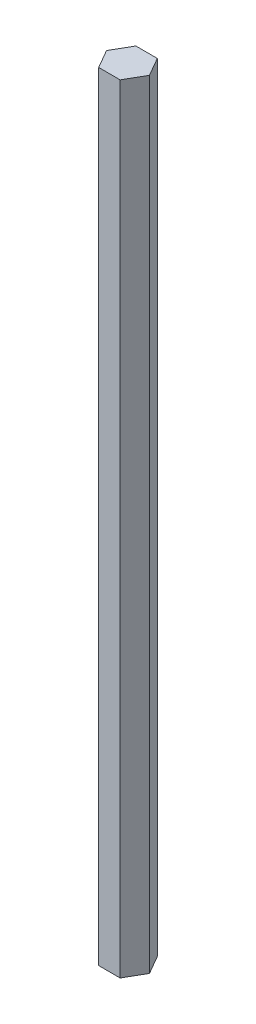
ISO-10303-21;
HEADER;
FILE_DESCRIPTION(('STEP AP214'),'2;1');
FILE_NAME('part.step','',(''),(''),'','','');
FILE_SCHEMA(('AUTOMOTIVE_DESIGN { 1 0 10303 214 1 1 1 1 }'));
ENDSEC;
DATA;
#1=APPLICATION_CONTEXT('core data for automotive mechanical design processes');
#2=APPLICATION_PROTOCOL_DEFINITION('international standard','automotive_design',2000,#1);
#3=PRODUCT_CONTEXT('',#1,'mechanical');
#4=PRODUCT('Part','Part','',(#3));
#5=PRODUCT_RELATED_PRODUCT_CATEGORY('part','',(#4));
#6=PRODUCT_DEFINITION_FORMATION('','',#4);
#7=PRODUCT_DEFINITION_CONTEXT('part definition',#1,'design');
#8=PRODUCT_DEFINITION('design','',#6,#7);
#9=PRODUCT_DEFINITION_SHAPE('','',#8);
#10=(LENGTH_UNIT() NAMED_UNIT(*) SI_UNIT(.MILLI.,.METRE.));
#11=(NAMED_UNIT(*) PLANE_ANGLE_UNIT() SI_UNIT($,.RADIAN.));
#12=(NAMED_UNIT(*) SI_UNIT($,.STERADIAN.) SOLID_ANGLE_UNIT());
#13=UNCERTAINTY_MEASURE_WITH_UNIT(LENGTH_MEASURE(1.E-05),#10,'distance_accuracy_value','');
#14=(GEOMETRIC_REPRESENTATION_CONTEXT(3) GLOBAL_UNCERTAINTY_ASSIGNED_CONTEXT((#13)) GLOBAL_UNIT_ASSIGNED_CONTEXT((#10,
#11,#12)) REPRESENTATION_CONTEXT('',''));
#15=CARTESIAN_POINT('',(0.,0.,0.));
#16=DIRECTION('',(0.,0.,1.));
#17=DIRECTION('',(1.,0.,0.));
#18=AXIS2_PLACEMENT_3D('',#15,#16,#17);
#19=CARTESIAN_POINT('',(3.97705905170191,290.,5.34885921686965));
#20=DIRECTION('',(-0.866025403784439,0.,-0.5));
#21=DIRECTION('',(-0.5,0.,0.866025403784439));
#22=AXIS2_PLACEMENT_3D('',#19,#20,#21);
#23=PLANE('',#22);
#24=DIRECTION('',(0.5,0.,-0.866025403784439));
#25=VECTOR('',#24,1.);
#26=CARTESIAN_POINT('',(3.97705905170191,0.,5.34885921686965));
#27=LINE('',#26,#25);
#28=CARTESIAN_POINT('',(3.97705905170191,0.,5.34885921686965));
#29=VERTEX_POINT('',#28);
#30=CARTESIAN_POINT('',(7.97705905170191,0.,-1.57934401340586));
#31=VERTEX_POINT('',#30);
#32=EDGE_CURVE('E132',#29,#31,#27,.T.);
#33=ORIENTED_EDGE('',*,*,#32,.T.);
#34=DIRECTION('',(0.,-1.,0.));
#35=VECTOR('',#34,1.);
#36=CARTESIAN_POINT('',(7.97705905170191,290.,-1.57934401340586));
#37=LINE('',#36,#35);
#38=CARTESIAN_POINT('',(7.97705905170191,290.,-1.57934401340586));
#39=VERTEX_POINT('',#38);
#40=EDGE_CURVE('E11',#39,#31,#37,.T.);
#41=ORIENTED_EDGE('',*,*,#40,.F.);
#42=DIRECTION('',(0.5,0.,-0.866025403784439));
#43=VECTOR('',#42,1.);
#44=CARTESIAN_POINT('',(3.97705905170191,290.,5.34885921686965));
#45=LINE('',#44,#43);
#46=CARTESIAN_POINT('',(3.97705905170191,290.,5.34885921686965));
#47=VERTEX_POINT('',#46);
#48=EDGE_CURVE('E148',#47,#39,#45,.T.);
#49=ORIENTED_EDGE('',*,*,#48,.F.);
#50=DIRECTION('',(0.,-1.,0.));
#51=VECTOR('',#50,1.);
#52=CARTESIAN_POINT('',(3.97705905170191,290.,5.34885921686965));
#53=LINE('',#52,#51);
#54=EDGE_CURVE('E128',#47,#29,#53,.T.);
#55=ORIENTED_EDGE('',*,*,#54,.T.);
#56=EDGE_LOOP('',(#33,#41,#49,#55));
#57=FACE_BOUND('',#56,.T.);
#58=ADVANCED_FACE('F43',(#57),#23,.F.);
#59=CARTESIAN_POINT('',(7.97705905170191,290.,-1.57934401340586));
#60=DIRECTION('',(-0.866025403784439,0.,0.5));
#61=DIRECTION('',(0.5,0.,0.866025403784439));
#62=AXIS2_PLACEMENT_3D('',#59,#60,#61);
#63=PLANE('',#62);
#64=DIRECTION('',(-0.5,0.,-0.866025403784439));
#65=VECTOR('',#64,1.);
#66=CARTESIAN_POINT('',(7.97705905170191,0.,-1.57934401340586));
#67=LINE('',#66,#65);
#68=CARTESIAN_POINT('',(3.97705905170191,0.,-8.50754724368137));
#69=VERTEX_POINT('',#68);
#70=EDGE_CURVE('E136',#31,#69,#67,.T.);
#71=ORIENTED_EDGE('',*,*,#70,.T.);
#72=DIRECTION('',(0.,-1.,0.));
#73=VECTOR('',#72,1.);
#74=CARTESIAN_POINT('',(3.97705905170191,290.,-8.50754724368137));
#75=LINE('',#74,#73);
#76=CARTESIAN_POINT('',(3.97705905170191,290.,-8.50754724368137));
#77=VERTEX_POINT('',#76);
#78=EDGE_CURVE('E52',#77,#69,#75,.T.);
#79=ORIENTED_EDGE('',*,*,#78,.F.);
#80=DIRECTION('',(-0.5,0.,-0.866025403784439));
#81=VECTOR('',#80,1.);
#82=CARTESIAN_POINT('',(7.97705905170191,290.,-1.57934401340586));
#83=LINE('',#82,#81);
#84=EDGE_CURVE('E97',#39,#77,#83,.T.);
#85=ORIENTED_EDGE('',*,*,#84,.F.);
#86=ORIENTED_EDGE('',*,*,#40,.T.);
#87=EDGE_LOOP('',(#71,#79,#85,#86));
#88=FACE_BOUND('',#87,.T.);
#89=ADVANCED_FACE('F176',(#88),#63,.F.);
#90=CARTESIAN_POINT('',(3.97705905170191,290.,-8.50754724368137));
#91=DIRECTION('',(0.,0.,1.));
#92=DIRECTION('',(1.,0.,0.));
#93=AXIS2_PLACEMENT_3D('',#90,#91,#92);
#94=PLANE('',#93);
#95=DIRECTION('',(-1.,0.,0.));
#96=VECTOR('',#95,1.);
#97=CARTESIAN_POINT('',(3.97705905170191,0.,-8.50754724368137));
#98=LINE('',#97,#96);
#99=CARTESIAN_POINT('',(-4.02294094829809,0.,-8.50754724368137));
#100=VERTEX_POINT('',#99);
#101=EDGE_CURVE('E139',#69,#100,#98,.T.);
#102=ORIENTED_EDGE('',*,*,#101,.T.);
#103=DIRECTION('',(0.,-1.,0.));
#104=VECTOR('',#103,1.);
#105=CARTESIAN_POINT('',(-4.02294094829809,290.,-8.50754724368137));
#106=LINE('',#105,#104);
#107=CARTESIAN_POINT('',(-4.02294094829809,290.,-8.50754724368137));
#108=VERTEX_POINT('',#107);
#109=EDGE_CURVE('E121',#108,#100,#106,.T.);
#110=ORIENTED_EDGE('',*,*,#109,.F.);
#111=DIRECTION('',(-1.,0.,0.));
#112=VECTOR('',#111,1.);
#113=CARTESIAN_POINT('',(3.97705905170191,290.,-8.50754724368137));
#114=LINE('',#113,#112);
#115=EDGE_CURVE('E110',#77,#108,#114,.T.);
#116=ORIENTED_EDGE('',*,*,#115,.F.);
#117=ORIENTED_EDGE('',*,*,#78,.T.);
#118=EDGE_LOOP('',(#102,#110,#116,#117));
#119=FACE_BOUND('',#118,.T.);
#120=ADVANCED_FACE('F158',(#119),#94,.F.);
#121=CARTESIAN_POINT('',(-4.02294094829809,290.,-8.50754724368137));
#122=DIRECTION('',(0.866025403784439,0.,0.5));
#123=DIRECTION('',(0.5,0.,-0.866025403784439));
#124=AXIS2_PLACEMENT_3D('',#121,#122,#123);
#125=PLANE('',#124);
#126=DIRECTION('',(-0.5,0.,0.866025403784439));
#127=VECTOR('',#126,1.);
#128=CARTESIAN_POINT('',(-4.02294094829809,0.,-8.50754724368137));
#129=LINE('',#128,#127);
#130=CARTESIAN_POINT('',(-8.02294094829809,0.,-1.57934401340586));
#131=VERTEX_POINT('',#130);
#132=EDGE_CURVE('E119',#100,#131,#129,.T.);
#133=ORIENTED_EDGE('',*,*,#132,.T.);
#134=DIRECTION('',(0.,-1.,0.));
#135=VECTOR('',#134,1.);
#136=CARTESIAN_POINT('',(-8.02294094829809,290.,-1.57934401340586));
#137=LINE('',#136,#135);
#138=CARTESIAN_POINT('',(-8.02294094829809,290.,-1.57934401340586));
#139=VERTEX_POINT('',#138);
#140=EDGE_CURVE('E116',#139,#131,#137,.T.);
#141=ORIENTED_EDGE('',*,*,#140,.F.);
#142=DIRECTION('',(-0.5,0.,0.866025403784439));
#143=VECTOR('',#142,1.);
#144=CARTESIAN_POINT('',(-4.02294094829809,290.,-8.50754724368137));
#145=LINE('',#144,#143);
#146=EDGE_CURVE('E104',#108,#139,#145,.T.);
#147=ORIENTED_EDGE('',*,*,#146,.F.);
#148=ORIENTED_EDGE('',*,*,#109,.T.);
#149=EDGE_LOOP('',(#133,#141,#147,#148));
#150=FACE_BOUND('',#149,.T.);
#151=ADVANCED_FACE('F117',(#150),#125,.F.);
#152=CARTESIAN_POINT('',(-8.02294094829809,290.,-1.57934401340586));
#153=DIRECTION('',(0.866025403784438,0.,-0.500000000000001));
#154=DIRECTION('',(-0.500000000000001,0.,-0.866025403784438));
#155=AXIS2_PLACEMENT_3D('',#152,#153,#154);
#156=PLANE('',#155);
#157=DIRECTION('',(0.500000000000001,0.,0.866025403784438));
#158=VECTOR('',#157,1.);
#159=CARTESIAN_POINT('',(-8.02294094829809,0.,-1.57934401340586));
#160=LINE('',#159,#158);
#161=CARTESIAN_POINT('',(-4.02294094829809,0.,5.34885921686965));
#162=VERTEX_POINT('',#161);
#163=EDGE_CURVE('E83',#131,#162,#160,.T.);
#164=ORIENTED_EDGE('',*,*,#163,.T.);
#165=DIRECTION('',(0.,-1.,0.));
#166=VECTOR('',#165,1.);
#167=CARTESIAN_POINT('',(-4.02294094829809,290.,5.34885921686965));
#168=LINE('',#167,#166);
#169=CARTESIAN_POINT('',(-4.02294094829809,290.,5.34885921686965));
#170=VERTEX_POINT('',#169);
#171=EDGE_CURVE('E122',#170,#162,#168,.T.);
#172=ORIENTED_EDGE('',*,*,#171,.F.);
#173=DIRECTION('',(0.500000000000001,0.,0.866025403784438));
#174=VECTOR('',#173,1.);
#175=CARTESIAN_POINT('',(-8.02294094829809,290.,-1.57934401340586));
#176=LINE('',#175,#174);
#177=EDGE_CURVE('E108',#139,#170,#176,.T.);
#178=ORIENTED_EDGE('',*,*,#177,.F.);
#179=ORIENTED_EDGE('',*,*,#140,.T.);
#180=EDGE_LOOP('',(#164,#172,#178,#179));
#181=FACE_BOUND('',#180,.T.);
#182=ADVANCED_FACE('F124',(#181),#156,.F.);
#183=CARTESIAN_POINT('',(-4.02294094829809,290.,5.34885921686965));
#184=DIRECTION('',(0.,0.,-1.));
#185=DIRECTION('',(-1.,0.,0.));
#186=AXIS2_PLACEMENT_3D('',#183,#184,#185);
#187=PLANE('',#186);
#188=DIRECTION('',(1.,0.,0.));
#189=VECTOR('',#188,1.);
#190=CARTESIAN_POINT('',(-4.02294094829809,0.,5.34885921686965));
#191=LINE('',#190,#189);
#192=EDGE_CURVE('E89',#162,#29,#191,.T.);
#193=ORIENTED_EDGE('',*,*,#192,.T.);
#194=ORIENTED_EDGE('',*,*,#54,.F.);
#195=DIRECTION('',(1.,0.,0.));
#196=VECTOR('',#195,1.);
#197=CARTESIAN_POINT('',(-4.02294094829809,290.,5.34885921686965));
#198=LINE('',#197,#196);
#199=EDGE_CURVE('E60',#170,#47,#198,.T.);
#200=ORIENTED_EDGE('',*,*,#199,.F.);
#201=ORIENTED_EDGE('',*,*,#171,.T.);
#202=EDGE_LOOP('',(#193,#194,#200,#201));
#203=FACE_BOUND('',#202,.T.);
#204=ADVANCED_FACE('F165',(#203),#187,.F.);
#205=CARTESIAN_POINT('',(0.,290.,0.));
#206=DIRECTION('',(0.,1.,0.));
#207=DIRECTION('',(0.,0.,1.));
#208=AXIS2_PLACEMENT_3D('',#205,#206,#207);
#209=PLANE('',#208);
#210=ORIENTED_EDGE('',*,*,#48,.T.);
#211=ORIENTED_EDGE('',*,*,#84,.T.);
#212=ORIENTED_EDGE('',*,*,#115,.T.);
#213=ORIENTED_EDGE('',*,*,#146,.T.);
#214=ORIENTED_EDGE('',*,*,#177,.T.);
#215=ORIENTED_EDGE('',*,*,#199,.T.);
#216=EDGE_LOOP('',(#210,#211,#212,#213,#214,#215));
#217=FACE_BOUND('',#216,.T.);
#218=ADVANCED_FACE('F106',(#217),#209,.T.);
#219=CARTESIAN_POINT('',(0.,0.,0.));
#220=DIRECTION('',(0.,1.,0.));
#221=DIRECTION('',(0.,0.,1.));
#222=AXIS2_PLACEMENT_3D('',#219,#220,#221);
#223=PLANE('',#222);
#224=ORIENTED_EDGE('',*,*,#32,.F.);
#225=ORIENTED_EDGE('',*,*,#192,.F.);
#226=ORIENTED_EDGE('',*,*,#163,.F.);
#227=ORIENTED_EDGE('',*,*,#132,.F.);
#228=ORIENTED_EDGE('',*,*,#101,.F.);
#229=ORIENTED_EDGE('',*,*,#70,.F.);
#230=EDGE_LOOP('',(#224,#225,#226,#227,#228,#229));
#231=FACE_BOUND('',#230,.T.);
#232=ADVANCED_FACE('F161',(#231),#223,.F.);
#233=CLOSED_SHELL('',(#58,#89,#120,#151,#182,#204,#218,#232));
#234=MANIFOLD_SOLID_BREP('B2',#233);
#235=ADVANCED_BREP_SHAPE_REPRESENTATION('',(#18,#234),#14);
#236=SHAPE_DEFINITION_REPRESENTATION(#9,#235);
ENDSEC;
END-ISO-10303-21;
